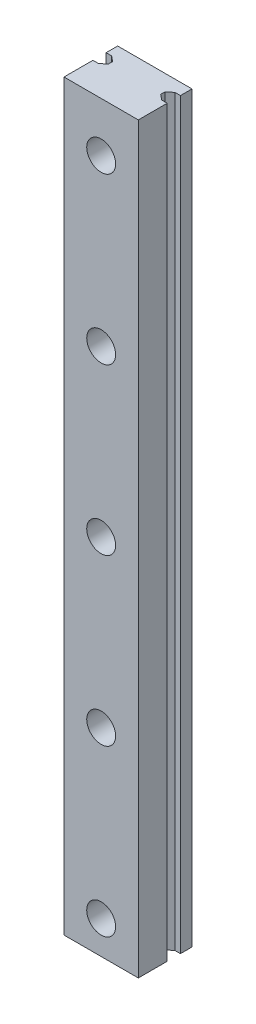
ISO-10303-21;
HEADER;
FILE_DESCRIPTION(('STEP AP214'),'2;1');
FILE_NAME('part.step','',(''),(''),'','','');
FILE_SCHEMA(('AUTOMOTIVE_DESIGN { 1 0 10303 214 1 1 1 1 }'));
ENDSEC;
DATA;
#1=APPLICATION_CONTEXT('core data for automotive mechanical design processes');
#2=APPLICATION_PROTOCOL_DEFINITION('international standard','automotive_design',2000,#1);
#3=PRODUCT_CONTEXT('',#1,'mechanical');
#4=PRODUCT('Part','Part','',(#3));
#5=PRODUCT_RELATED_PRODUCT_CATEGORY('part','',(#4));
#6=PRODUCT_DEFINITION_FORMATION('','',#4);
#7=PRODUCT_DEFINITION_CONTEXT('part definition',#1,'design');
#8=PRODUCT_DEFINITION('design','',#6,#7);
#9=PRODUCT_DEFINITION_SHAPE('','',#8);
#10=(LENGTH_UNIT() NAMED_UNIT(*) SI_UNIT(.MILLI.,.METRE.));
#11=(NAMED_UNIT(*) PLANE_ANGLE_UNIT() SI_UNIT($,.RADIAN.));
#12=(NAMED_UNIT(*) SI_UNIT($,.STERADIAN.) SOLID_ANGLE_UNIT());
#13=UNCERTAINTY_MEASURE_WITH_UNIT(LENGTH_MEASURE(1.E-05),#10,'distance_accuracy_value','');
#14=(GEOMETRIC_REPRESENTATION_CONTEXT(3) GLOBAL_UNCERTAINTY_ASSIGNED_CONTEXT((#13)) GLOBAL_UNIT_ASSIGNED_CONTEXT((#10,
#11,#12)) REPRESENTATION_CONTEXT('',''));
#15=CARTESIAN_POINT('',(0.,0.,0.));
#16=DIRECTION('',(0.,0.,1.));
#17=DIRECTION('',(1.,0.,0.));
#18=AXIS2_PLACEMENT_3D('',#15,#16,#17);
#19=CARTESIAN_POINT('',(3.175,0.,-4.57));
#20=DIRECTION('',(-1.,0.,0.));
#21=DIRECTION('',(0.,0.,1.));
#22=AXIS2_PLACEMENT_3D('',#19,#20,#21);
#23=PLANE('',#22);
#24=DIRECTION('',(0.,1.,0.));
#25=VECTOR('',#24,1.);
#26=CARTESIAN_POINT('',(3.175,45.,-4.57));
#27=LINE('',#26,#25);
#28=CARTESIAN_POINT('',(3.1750000005,0.,-4.569999999875));
#29=VERTEX_POINT('',#28);
#30=CARTESIAN_POINT('',(3.1750000005,90.,-4.569999999875));
#31=VERTEX_POINT('',#30);
#32=EDGE_CURVE('E136',#29,#31,#27,.T.);
#33=ORIENTED_EDGE('',*,*,#32,.T.);
#34=DIRECTION('',(0.,0.,-1.));
#35=VECTOR('',#34,1.);
#36=CARTESIAN_POINT('',(3.175,90.,-4.3));
#37=LINE('',#36,#35);
#38=CARTESIAN_POINT('',(3.175000001,90.,-4.03));
#39=VERTEX_POINT('',#38);
#40=EDGE_CURVE('E132',#39,#31,#37,.T.);
#41=ORIENTED_EDGE('',*,*,#40,.F.);
#42=DIRECTION('',(0.,-1.,0.));
#43=VECTOR('',#42,1.);
#44=CARTESIAN_POINT('',(3.175,45.,-4.03));
#45=LINE('',#44,#43);
#46=CARTESIAN_POINT('',(3.1750000005,0.,-4.03));
#47=VERTEX_POINT('',#46);
#48=EDGE_CURVE('E134',#39,#47,#45,.T.);
#49=ORIENTED_EDGE('',*,*,#48,.T.);
#50=DIRECTION('',(0.,0.,1.));
#51=VECTOR('',#50,1.);
#52=CARTESIAN_POINT('',(3.175,0.,-4.3));
#53=LINE('',#52,#51);
#54=EDGE_CURVE('E126',#29,#47,#53,.T.);
#55=ORIENTED_EDGE('',*,*,#54,.F.);
#56=EDGE_LOOP('',(#33,#41,#49,#55));
#57=FACE_BOUND('',#56,.T.);
#58=ADVANCED_FACE('F17',(#57),#23,.F.);
#59=CARTESIAN_POINT('',(-3.175,0.,-4.03));
#60=DIRECTION('',(1.,0.,0.));
#61=DIRECTION('',(0.,0.,-1.));
#62=AXIS2_PLACEMENT_3D('',#59,#60,#61);
#63=PLANE('',#62);
#64=DIRECTION('',(0.,1.,0.));
#65=VECTOR('',#64,1.);
#66=CARTESIAN_POINT('',(-3.175,45.,-4.03));
#67=LINE('',#66,#65);
#68=CARTESIAN_POINT('',(-3.1750000005,0.,-4.03));
#69=VERTEX_POINT('',#68);
#70=CARTESIAN_POINT('',(-3.1750000005,90.,-4.03));
#71=VERTEX_POINT('',#70);
#72=EDGE_CURVE('E282',#69,#71,#67,.T.);
#73=ORIENTED_EDGE('',*,*,#72,.T.);
#74=DIRECTION('',(0.,0.,1.));
#75=VECTOR('',#74,1.);
#76=CARTESIAN_POINT('',(-3.175,90.,-4.3));
#77=LINE('',#76,#75);
#78=CARTESIAN_POINT('',(-3.175000001,90.,-4.56999999975));
#79=VERTEX_POINT('',#78);
#80=EDGE_CURVE('E154',#79,#71,#77,.T.);
#81=ORIENTED_EDGE('',*,*,#80,.F.);
#82=DIRECTION('',(0.,-1.,0.));
#83=VECTOR('',#82,1.);
#84=CARTESIAN_POINT('',(-3.175,45.,-4.57));
#85=LINE('',#84,#83);
#86=CARTESIAN_POINT('',(-3.1750000005,0.,-4.569999999875));
#87=VERTEX_POINT('',#86);
#88=EDGE_CURVE('E266',#79,#87,#85,.T.);
#89=ORIENTED_EDGE('',*,*,#88,.T.);
#90=DIRECTION('',(0.,0.,-1.));
#91=VECTOR('',#90,1.);
#92=CARTESIAN_POINT('',(-3.175,0.,-4.3));
#93=LINE('',#92,#91);
#94=EDGE_CURVE('E152',#69,#87,#93,.T.);
#95=ORIENTED_EDGE('',*,*,#94,.F.);
#96=EDGE_LOOP('',(#73,#81,#89,#95));
#97=FACE_BOUND('',#96,.T.);
#98=ADVANCED_FACE('F355',(#97),#63,.F.);
#99=CARTESIAN_POINT('',(3.175,0.,-4.03));
#100=DIRECTION('',(-0.624695047554425,0.,0.78086880944303));
#101=DIRECTION('',(0.78086880944303,0.,0.624695047554425));
#102=AXIS2_PLACEMENT_3D('',#99,#100,#101);
#103=PLANE('',#102);
#104=ORIENTED_EDGE('',*,*,#48,.F.);
#105=DIRECTION('',(-0.78086880944303,0.,-0.624695047554425));
#106=VECTOR('',#105,1.);
#107=CARTESIAN_POINT('',(3.50625,90.,-3.765));
#108=LINE('',#107,#106);
#109=CARTESIAN_POINT('',(3.8375000005,90.,-3.4999999985));
#110=VERTEX_POINT('',#109);
#111=EDGE_CURVE('E144',#110,#39,#108,.T.);
#112=ORIENTED_EDGE('',*,*,#111,.F.);
#113=DIRECTION('',(0.,-1.,0.));
#114=VECTOR('',#113,1.);
#115=CARTESIAN_POINT('',(3.8375,45.,-3.5));
#116=LINE('',#115,#114);
#117=CARTESIAN_POINT('',(3.83750000025,0.,-3.49999999925));
#118=VERTEX_POINT('',#117);
#119=EDGE_CURVE('E261',#110,#118,#116,.T.);
#120=ORIENTED_EDGE('',*,*,#119,.T.);
#121=DIRECTION('',(0.78086880944303,0.,0.624695047554425));
#122=VECTOR('',#121,1.);
#123=CARTESIAN_POINT('',(3.50625,0.,-3.765));
#124=LINE('',#123,#122);
#125=EDGE_CURVE('E146',#47,#118,#124,.T.);
#126=ORIENTED_EDGE('',*,*,#125,.F.);
#127=EDGE_LOOP('',(#104,#112,#120,#126));
#128=FACE_BOUND('',#127,.T.);
#129=ADVANCED_FACE('F142',(#128),#103,.F.);
#130=CARTESIAN_POINT('',(-3.8375,0.,-3.5));
#131=DIRECTION('',(0.624695047554425,0.,0.78086880944303));
#132=DIRECTION('',(0.78086880944303,0.,-0.624695047554425));
#133=AXIS2_PLACEMENT_3D('',#130,#131,#132);
#134=PLANE('',#133);
#135=DIRECTION('',(0.,1.,0.));
#136=VECTOR('',#135,1.);
#137=CARTESIAN_POINT('',(-3.8375,45.,-3.5));
#138=LINE('',#137,#136);
#139=CARTESIAN_POINT('',(-3.83750000025,0.,-3.49999999925));
#140=VERTEX_POINT('',#139);
#141=CARTESIAN_POINT('',(-3.83750000025,90.,-3.49999999925));
#142=VERTEX_POINT('',#141);
#143=EDGE_CURVE('E256',#140,#142,#138,.T.);
#144=ORIENTED_EDGE('',*,*,#143,.T.);
#145=DIRECTION('',(-0.78086880944303,0.,0.624695047554425));
#146=VECTOR('',#145,1.);
#147=CARTESIAN_POINT('',(-3.50625,90.,-3.765));
#148=LINE('',#147,#146);
#149=EDGE_CURVE('E280',#71,#142,#148,.T.);
#150=ORIENTED_EDGE('',*,*,#149,.F.);
#151=ORIENTED_EDGE('',*,*,#72,.F.);
#152=DIRECTION('',(0.78086880944303,0.,-0.624695047554425));
#153=VECTOR('',#152,1.);
#154=CARTESIAN_POINT('',(-3.50625,0.,-3.765));
#155=LINE('',#154,#153);
#156=EDGE_CURVE('E277',#140,#69,#155,.T.);
#157=ORIENTED_EDGE('',*,*,#156,.F.);
#158=EDGE_LOOP('',(#144,#150,#151,#157));
#159=FACE_BOUND('',#158,.T.);
#160=ADVANCED_FACE('F360',(#159),#134,.F.);
#161=CARTESIAN_POINT('',(3.8375,0.,-5.1));
#162=DIRECTION('',(-0.624695047554424,0.,-0.780868809443031));
#163=DIRECTION('',(-0.780868809443031,0.,0.624695047554424));
#164=AXIS2_PLACEMENT_3D('',#161,#162,#163);
#165=PLANE('',#164);
#166=DIRECTION('',(0.,1.,0.));
#167=VECTOR('',#166,1.);
#168=CARTESIAN_POINT('',(3.8375,45.,-5.1));
#169=LINE('',#168,#167);
#170=CARTESIAN_POINT('',(3.83750000025,0.,-5.100000000625));
#171=VERTEX_POINT('',#170);
#172=CARTESIAN_POINT('',(3.83750000025,90.,-5.100000000625));
#173=VERTEX_POINT('',#172);
#174=EDGE_CURVE('E248',#171,#173,#169,.T.);
#175=ORIENTED_EDGE('',*,*,#174,.T.);
#176=DIRECTION('',(0.780868809443031,0.,-0.624695047554424));
#177=VECTOR('',#176,1.);
#178=CARTESIAN_POINT('',(3.50625,90.,-4.835));
#179=LINE('',#178,#177);
#180=EDGE_CURVE('E274',#31,#173,#179,.T.);
#181=ORIENTED_EDGE('',*,*,#180,.F.);
#182=ORIENTED_EDGE('',*,*,#32,.F.);
#183=DIRECTION('',(-0.780868809443031,0.,0.624695047554424));
#184=VECTOR('',#183,1.);
#185=CARTESIAN_POINT('',(3.50625,0.,-4.835));
#186=LINE('',#185,#184);
#187=EDGE_CURVE('E272',#171,#29,#186,.T.);
#188=ORIENTED_EDGE('',*,*,#187,.F.);
#189=EDGE_LOOP('',(#175,#181,#182,#188));
#190=FACE_BOUND('',#189,.T.);
#191=ADVANCED_FACE('F441',(#190),#165,.F.);
#192=CARTESIAN_POINT('',(-3.175,0.,-4.57));
#193=DIRECTION('',(0.624695047554424,0.,-0.780868809443031));
#194=DIRECTION('',(-0.780868809443031,0.,-0.624695047554424));
#195=AXIS2_PLACEMENT_3D('',#192,#193,#194);
#196=PLANE('',#195);
#197=ORIENTED_EDGE('',*,*,#88,.F.);
#198=DIRECTION('',(0.780868809443031,0.,0.624695047554424));
#199=VECTOR('',#198,1.);
#200=CARTESIAN_POINT('',(-3.50625,90.,-4.835));
#201=LINE('',#200,#199);
#202=CARTESIAN_POINT('',(-3.83750000025,90.,-5.100000000625));
#203=VERTEX_POINT('',#202);
#204=EDGE_CURVE('E269',#203,#79,#201,.T.);
#205=ORIENTED_EDGE('',*,*,#204,.F.);
#206=DIRECTION('',(0.,-1.,0.));
#207=VECTOR('',#206,1.);
#208=CARTESIAN_POINT('',(-3.8375,45.,-5.1));
#209=LINE('',#208,#207);
#210=CARTESIAN_POINT('',(-3.83750000025,0.,-5.100000000625));
#211=VERTEX_POINT('',#210);
#212=EDGE_CURVE('E240',#203,#211,#209,.T.);
#213=ORIENTED_EDGE('',*,*,#212,.T.);
#214=DIRECTION('',(-0.780868809443031,0.,-0.624695047554424));
#215=VECTOR('',#214,1.);
#216=CARTESIAN_POINT('',(-3.50625,0.,-4.835));
#217=LINE('',#216,#215);
#218=EDGE_CURVE('E264',#87,#211,#217,.T.);
#219=ORIENTED_EDGE('',*,*,#218,.F.);
#220=EDGE_LOOP('',(#197,#205,#213,#219));
#221=FACE_BOUND('',#220,.T.);
#222=ADVANCED_FACE('F353',(#221),#196,.F.);
#223=CARTESIAN_POINT('',(3.8375,0.,-3.5));
#224=DIRECTION('',(0.,0.,1.));
#225=DIRECTION('',(1.,0.,0.));
#226=AXIS2_PLACEMENT_3D('',#223,#224,#225);
#227=PLANE('',#226);
#228=ORIENTED_EDGE('',*,*,#119,.F.);
#229=DIRECTION('',(-1.,0.,0.));
#230=VECTOR('',#229,1.);
#231=CARTESIAN_POINT('',(4.16875,90.,-3.5));
#232=LINE('',#231,#230);
#233=CARTESIAN_POINT('',(4.5,90.,-3.49999999925));
#234=VERTEX_POINT('',#233);
#235=EDGE_CURVE('E151',#234,#110,#232,.T.);
#236=ORIENTED_EDGE('',*,*,#235,.F.);
#237=DIRECTION('',(0.,-1.,0.));
#238=VECTOR('',#237,1.);
#239=CARTESIAN_POINT('',(4.5,45.,-3.5));
#240=LINE('',#239,#238);
#241=CARTESIAN_POINT('',(4.5,0.,-3.49999999925));
#242=VERTEX_POINT('',#241);
#243=EDGE_CURVE('E235',#234,#242,#240,.T.);
#244=ORIENTED_EDGE('',*,*,#243,.T.);
#245=DIRECTION('',(1.,0.,0.));
#246=VECTOR('',#245,1.);
#247=CARTESIAN_POINT('',(4.16875,0.,-3.5));
#248=LINE('',#247,#246);
#249=EDGE_CURVE('E259',#118,#242,#248,.T.);
#250=ORIENTED_EDGE('',*,*,#249,.F.);
#251=EDGE_LOOP('',(#228,#236,#244,#250));
#252=FACE_BOUND('',#251,.T.);
#253=ADVANCED_FACE('F288',(#252),#227,.F.);
#254=CARTESIAN_POINT('',(-4.5,0.,-3.5));
#255=DIRECTION('',(0.,0.,1.));
#256=DIRECTION('',(1.,0.,0.));
#257=AXIS2_PLACEMENT_3D('',#254,#255,#256);
#258=PLANE('',#257);
#259=DIRECTION('',(0.,1.,0.));
#260=VECTOR('',#259,1.);
#261=CARTESIAN_POINT('',(-4.5,45.,-3.5));
#262=LINE('',#261,#260);
#263=CARTESIAN_POINT('',(-4.5,0.,-3.49999999925));
#264=VERTEX_POINT('',#263);
#265=CARTESIAN_POINT('',(-4.5,90.,-3.49999999925));
#266=VERTEX_POINT('',#265);
#267=EDGE_CURVE('E228',#264,#266,#262,.T.);
#268=ORIENTED_EDGE('',*,*,#267,.T.);
#269=DIRECTION('',(-1.,0.,0.));
#270=VECTOR('',#269,1.);
#271=CARTESIAN_POINT('',(-4.16875,90.,-3.5));
#272=LINE('',#271,#270);
#273=EDGE_CURVE('E254',#142,#266,#272,.T.);
#274=ORIENTED_EDGE('',*,*,#273,.F.);
#275=ORIENTED_EDGE('',*,*,#143,.F.);
#276=DIRECTION('',(1.,0.,0.));
#277=VECTOR('',#276,1.);
#278=CARTESIAN_POINT('',(-4.16875,0.,-3.5));
#279=LINE('',#278,#277);
#280=EDGE_CURVE('E251',#264,#140,#279,.T.);
#281=ORIENTED_EDGE('',*,*,#280,.F.);
#282=EDGE_LOOP('',(#268,#274,#275,#281));
#283=FACE_BOUND('',#282,.T.);
#284=ADVANCED_FACE('F363',(#283),#258,.F.);
#285=CARTESIAN_POINT('',(0.,24.,0.));
#286=DIRECTION('',(0.,0.,-1.));
#287=DIRECTION('',(-1.,0.,0.));
#288=AXIS2_PLACEMENT_3D('',#285,#286,#287);
#289=CYLINDRICAL_SURFACE('',#288,1.75);
#290=CARTESIAN_POINT('',(0.,24.,-3.));
#291=DIRECTION('',(0.,0.,-1.));
#292=DIRECTION('',(-1.,0.,0.));
#293=AXIS2_PLACEMENT_3D('',#290,#291,#292);
#294=CIRCLE('',#293,1.75);
#295=CARTESIAN_POINT('',(-1.75,24.,-3.));
#296=VERTEX_POINT('',#295);
#297=EDGE_CURVE('E205',#296,#296,#294,.F.);
#298=ORIENTED_EDGE('',*,*,#297,.F.);
#299=EDGE_LOOP('',(#298));
#300=FACE_BOUND('',#299,.T.);
#301=CARTESIAN_POINT('',(0.,24.,0.));
#302=DIRECTION('',(0.,0.,-1.));
#303=DIRECTION('',(-1.,0.,0.));
#304=AXIS2_PLACEMENT_3D('',#301,#302,#303);
#305=CIRCLE('',#304,1.75);
#306=CARTESIAN_POINT('',(-1.75,24.,0.));
#307=VERTEX_POINT('',#306);
#308=EDGE_CURVE('E21',#307,#307,#305,.F.);
#309=ORIENTED_EDGE('',*,*,#308,.T.);
#310=EDGE_LOOP('',(#309));
#311=FACE_BOUND('',#310,.T.);
#312=ADVANCED_FACE('F428',(#300,#311),#289,.F.);
#313=CARTESIAN_POINT('',(0.,4.,0.));
#314=DIRECTION('',(0.,0.,-1.));
#315=DIRECTION('',(-1.,0.,0.));
#316=AXIS2_PLACEMENT_3D('',#313,#314,#315);
#317=CYLINDRICAL_SURFACE('',#316,1.75);
#318=CARTESIAN_POINT('',(0.,4.,-3.));
#319=DIRECTION('',(0.,0.,-1.));
#320=DIRECTION('',(-1.,0.,0.));
#321=AXIS2_PLACEMENT_3D('',#318,#319,#320);
#322=CIRCLE('',#321,1.75);
#323=CARTESIAN_POINT('',(-1.75,4.,-3.));
#324=VERTEX_POINT('',#323);
#325=EDGE_CURVE('E202',#324,#324,#322,.F.);
#326=ORIENTED_EDGE('',*,*,#325,.F.);
#327=EDGE_LOOP('',(#326));
#328=FACE_BOUND('',#327,.T.);
#329=CARTESIAN_POINT('',(0.,4.,0.));
#330=DIRECTION('',(0.,0.,-1.));
#331=DIRECTION('',(-1.,0.,0.));
#332=AXIS2_PLACEMENT_3D('',#329,#330,#331);
#333=CIRCLE('',#332,1.75);
#334=CARTESIAN_POINT('',(-1.75,4.,0.));
#335=VERTEX_POINT('',#334);
#336=EDGE_CURVE('E213',#335,#335,#333,.F.);
#337=ORIENTED_EDGE('',*,*,#336,.T.);
#338=EDGE_LOOP('',(#337));
#339=FACE_BOUND('',#338,.T.);
#340=ADVANCED_FACE('F424',(#328,#339),#317,.F.);
#341=CARTESIAN_POINT('',(0.,44.,0.));
#342=DIRECTION('',(0.,0.,-1.));
#343=DIRECTION('',(-1.,0.,0.));
#344=AXIS2_PLACEMENT_3D('',#341,#342,#343);
#345=CYLINDRICAL_SURFACE('',#344,1.75);
#346=CARTESIAN_POINT('',(0.,44.,-3.));
#347=DIRECTION('',(0.,0.,-1.));
#348=DIRECTION('',(-1.,0.,0.));
#349=AXIS2_PLACEMENT_3D('',#346,#347,#348);
#350=CIRCLE('',#349,1.75);
#351=CARTESIAN_POINT('',(-1.75,44.,-3.));
#352=VERTEX_POINT('',#351);
#353=EDGE_CURVE('E199',#352,#352,#350,.F.);
#354=ORIENTED_EDGE('',*,*,#353,.F.);
#355=EDGE_LOOP('',(#354));
#356=FACE_BOUND('',#355,.T.);
#357=CARTESIAN_POINT('',(0.,44.,0.));
#358=DIRECTION('',(0.,0.,-1.));
#359=DIRECTION('',(-1.,0.,0.));
#360=AXIS2_PLACEMENT_3D('',#357,#358,#359);
#361=CIRCLE('',#360,1.75);
#362=CARTESIAN_POINT('',(-1.75,44.,0.));
#363=VERTEX_POINT('',#362);
#364=EDGE_CURVE('E211',#363,#363,#361,.F.);
#365=ORIENTED_EDGE('',*,*,#364,.T.);
#366=EDGE_LOOP('',(#365));
#367=FACE_BOUND('',#366,.T.);
#368=ADVANCED_FACE('F420',(#356,#367),#345,.F.);
#369=CARTESIAN_POINT('',(0.,64.,0.));
#370=DIRECTION('',(0.,0.,-1.));
#371=DIRECTION('',(-1.,0.,0.));
#372=AXIS2_PLACEMENT_3D('',#369,#370,#371);
#373=CYLINDRICAL_SURFACE('',#372,1.75);
#374=CARTESIAN_POINT('',(0.,64.,-3.));
#375=DIRECTION('',(0.,0.,-1.));
#376=DIRECTION('',(-1.,0.,0.));
#377=AXIS2_PLACEMENT_3D('',#374,#375,#376);
#378=CIRCLE('',#377,1.75);
#379=CARTESIAN_POINT('',(-1.75,64.,-3.));
#380=VERTEX_POINT('',#379);
#381=EDGE_CURVE('E196',#380,#380,#378,.F.);
#382=ORIENTED_EDGE('',*,*,#381,.F.);
#383=EDGE_LOOP('',(#382));
#384=FACE_BOUND('',#383,.T.);
#385=CARTESIAN_POINT('',(0.,64.,0.));
#386=DIRECTION('',(0.,0.,-1.));
#387=DIRECTION('',(-1.,0.,0.));
#388=AXIS2_PLACEMENT_3D('',#385,#386,#387);
#389=CIRCLE('',#388,1.75);
#390=CARTESIAN_POINT('',(-1.75,64.,0.));
#391=VERTEX_POINT('',#390);
#392=EDGE_CURVE('E208',#391,#391,#389,.F.);
#393=ORIENTED_EDGE('',*,*,#392,.T.);
#394=EDGE_LOOP('',(#393));
#395=FACE_BOUND('',#394,.T.);
#396=ADVANCED_FACE('F417',(#384,#395),#373,.F.);
#397=CARTESIAN_POINT('',(4.5,0.,-5.1));
#398=DIRECTION('',(0.,0.,-1.));
#399=DIRECTION('',(-1.,0.,0.));
#400=AXIS2_PLACEMENT_3D('',#397,#398,#399);
#401=PLANE('',#400);
#402=DIRECTION('',(0.,1.,0.));
#403=VECTOR('',#402,1.);
#404=CARTESIAN_POINT('',(4.5,45.,-5.1));
#405=LINE('',#404,#403);
#406=CARTESIAN_POINT('',(4.5,0.,-5.100000000625));
#407=VERTEX_POINT('',#406);
#408=CARTESIAN_POINT('',(4.5,90.,-5.100000000625));
#409=VERTEX_POINT('',#408);
#410=EDGE_CURVE('E195',#407,#409,#405,.T.);
#411=ORIENTED_EDGE('',*,*,#410,.T.);
#412=DIRECTION('',(1.,0.,0.));
#413=VECTOR('',#412,1.);
#414=CARTESIAN_POINT('',(4.16875,90.,-5.1));
#415=LINE('',#414,#413);
#416=EDGE_CURVE('E246',#173,#409,#415,.T.);
#417=ORIENTED_EDGE('',*,*,#416,.F.);
#418=ORIENTED_EDGE('',*,*,#174,.F.);
#419=DIRECTION('',(-1.,0.,0.));
#420=VECTOR('',#419,1.);
#421=CARTESIAN_POINT('',(4.16875,0.,-5.1));
#422=LINE('',#421,#420);
#423=EDGE_CURVE('E243',#407,#171,#422,.T.);
#424=ORIENTED_EDGE('',*,*,#423,.F.);
#425=EDGE_LOOP('',(#411,#417,#418,#424));
#426=FACE_BOUND('',#425,.T.);
#427=ADVANCED_FACE('F322',(#426),#401,.F.);
#428=CARTESIAN_POINT('',(-3.8375,0.,-5.1));
#429=DIRECTION('',(0.,0.,-1.));
#430=DIRECTION('',(-1.,0.,0.));
#431=AXIS2_PLACEMENT_3D('',#428,#429,#430);
#432=PLANE('',#431);
#433=ORIENTED_EDGE('',*,*,#212,.F.);
#434=DIRECTION('',(1.,0.,0.));
#435=VECTOR('',#434,1.);
#436=CARTESIAN_POINT('',(0.,90.,-5.1000000025));
#437=LINE('',#436,#435);
#438=CARTESIAN_POINT('',(-4.5,90.,-5.10000000125));
#439=VERTEX_POINT('',#438);
#440=EDGE_CURVE('E308',#439,#203,#437,.T.);
#441=ORIENTED_EDGE('',*,*,#440,.F.);
#442=DIRECTION('',(0.,-1.,0.));
#443=VECTOR('',#442,1.);
#444=CARTESIAN_POINT('',(-4.5,45.,-5.1));
#445=LINE('',#444,#443);
#446=CARTESIAN_POINT('',(-4.5,0.,-5.100000000625));
#447=VERTEX_POINT('',#446);
#448=EDGE_CURVE('E294',#439,#447,#445,.T.);
#449=ORIENTED_EDGE('',*,*,#448,.T.);
#450=DIRECTION('',(-1.,0.,0.));
#451=VECTOR('',#450,1.);
#452=CARTESIAN_POINT('',(-4.16875,0.,-5.1));
#453=LINE('',#452,#451);
#454=EDGE_CURVE('E238',#211,#447,#453,.T.);
#455=ORIENTED_EDGE('',*,*,#454,.F.);
#456=EDGE_LOOP('',(#433,#441,#449,#455));
#457=FACE_BOUND('',#456,.T.);
#458=ADVANCED_FACE('F348',(#457),#432,.F.);
#459=CARTESIAN_POINT('',(4.5,0.,-3.5));
#460=DIRECTION('',(-1.,0.,0.));
#461=DIRECTION('',(0.,0.,1.));
#462=AXIS2_PLACEMENT_3D('',#459,#460,#461);
#463=PLANE('',#462);
#464=ORIENTED_EDGE('',*,*,#243,.F.);
#465=DIRECTION('',(0.,0.,-1.));
#466=VECTOR('',#465,1.);
#467=CARTESIAN_POINT('',(4.5,90.,-3.25));
#468=LINE('',#467,#466);
#469=CARTESIAN_POINT('',(4.5,90.,0.));
#470=VERTEX_POINT('',#469);
#471=EDGE_CURVE('E313',#470,#234,#468,.T.);
#472=ORIENTED_EDGE('',*,*,#471,.F.);
#473=DIRECTION('',(0.,-1.,0.));
#474=VECTOR('',#473,1.);
#475=CARTESIAN_POINT('',(4.5,45.,0.));
#476=LINE('',#475,#474);
#477=CARTESIAN_POINT('',(4.5,0.,0.));
#478=VERTEX_POINT('',#477);
#479=EDGE_CURVE('E218',#470,#478,#476,.T.);
#480=ORIENTED_EDGE('',*,*,#479,.T.);
#481=DIRECTION('',(0.,0.,-1.));
#482=VECTOR('',#481,1.);
#483=CARTESIAN_POINT('',(4.5,0.,-3.25));
#484=LINE('',#483,#482);
#485=EDGE_CURVE('E290',#478,#242,#484,.T.);
#486=ORIENTED_EDGE('',*,*,#485,.T.);
#487=EDGE_LOOP('',(#464,#472,#480,#486));
#488=FACE_BOUND('',#487,.T.);
#489=ADVANCED_FACE('F291',(#488),#463,.F.);
#490=CARTESIAN_POINT('',(-4.5,0.,0.));
#491=DIRECTION('',(1.,0.,0.));
#492=DIRECTION('',(0.,0.,-1.));
#493=AXIS2_PLACEMENT_3D('',#490,#491,#492);
#494=PLANE('',#493);
#495=DIRECTION('',(0.,1.,0.));
#496=VECTOR('',#495,1.);
#497=CARTESIAN_POINT('',(-4.5,45.,0.));
#498=LINE('',#497,#496);
#499=CARTESIAN_POINT('',(-4.5,0.,0.));
#500=VERTEX_POINT('',#499);
#501=CARTESIAN_POINT('',(-4.5,90.,0.));
#502=VERTEX_POINT('',#501);
#503=EDGE_CURVE('E222',#500,#502,#498,.T.);
#504=ORIENTED_EDGE('',*,*,#503,.T.);
#505=DIRECTION('',(0.,0.,1.));
#506=VECTOR('',#505,1.);
#507=CARTESIAN_POINT('',(-4.5,90.,-3.25));
#508=LINE('',#507,#506);
#509=EDGE_CURVE('E305',#266,#502,#508,.T.);
#510=ORIENTED_EDGE('',*,*,#509,.F.);
#511=ORIENTED_EDGE('',*,*,#267,.F.);
#512=DIRECTION('',(0.,0.,1.));
#513=VECTOR('',#512,1.);
#514=CARTESIAN_POINT('',(-4.5,0.,-3.25));
#515=LINE('',#514,#513);
#516=EDGE_CURVE('E341',#264,#500,#515,.T.);
#517=ORIENTED_EDGE('',*,*,#516,.T.);
#518=EDGE_LOOP('',(#504,#510,#511,#517));
#519=FACE_BOUND('',#518,.T.);
#520=ADVANCED_FACE('F366',(#519),#494,.F.);
#521=CARTESIAN_POINT('',(4.5,0.,0.));
#522=DIRECTION('',(0.,0.,-1.));
#523=DIRECTION('',(-1.,0.,0.));
#524=AXIS2_PLACEMENT_3D('',#521,#522,#523);
#525=PLANE('',#524);
#526=CARTESIAN_POINT('',(0.,84.,0.));
#527=DIRECTION('',(0.,0.,-1.));
#528=DIRECTION('',(-1.,0.,0.));
#529=AXIS2_PLACEMENT_3D('',#526,#527,#528);
#530=CIRCLE('',#529,1.75);
#531=CARTESIAN_POINT('',(-1.75,84.,0.));
#532=VERTEX_POINT('',#531);
#533=EDGE_CURVE('E192',#532,#532,#530,.F.);
#534=ORIENTED_EDGE('',*,*,#533,.F.);
#535=EDGE_LOOP('',(#534));
#536=FACE_BOUND('',#535,.T.);
#537=ORIENTED_EDGE('',*,*,#392,.F.);
#538=EDGE_LOOP('',(#537));
#539=FACE_BOUND('',#538,.T.);
#540=ORIENTED_EDGE('',*,*,#364,.F.);
#541=EDGE_LOOP('',(#540));
#542=FACE_BOUND('',#541,.T.);
#543=ORIENTED_EDGE('',*,*,#336,.F.);
#544=EDGE_LOOP('',(#543));
#545=FACE_BOUND('',#544,.T.);
#546=ORIENTED_EDGE('',*,*,#308,.F.);
#547=EDGE_LOOP('',(#546));
#548=FACE_BOUND('',#547,.T.);
#549=ORIENTED_EDGE('',*,*,#479,.F.);
#550=DIRECTION('',(1.,0.,0.));
#551=VECTOR('',#550,1.);
#552=CARTESIAN_POINT('',(0.,90.,0.));
#553=LINE('',#552,#551);
#554=EDGE_CURVE('E314',#502,#470,#553,.T.);
#555=ORIENTED_EDGE('',*,*,#554,.F.);
#556=ORIENTED_EDGE('',*,*,#503,.F.);
#557=DIRECTION('',(1.,0.,0.));
#558=VECTOR('',#557,1.);
#559=CARTESIAN_POINT('',(0.,0.,0.));
#560=LINE('',#559,#558);
#561=EDGE_CURVE('E191',#500,#478,#560,.T.);
#562=ORIENTED_EDGE('',*,*,#561,.T.);
#563=EDGE_LOOP('',(#549,#555,#556,#562));
#564=FACE_BOUND('',#563,.T.);
#565=ADVANCED_FACE('F369',(#536,#539,#542,#545,#548,#564),#525,.F.);
#566=CARTESIAN_POINT('',(3.036,20.964,-3.));
#567=DIRECTION('',(0.,0.,-1.));
#568=DIRECTION('',(-1.,0.,0.));
#569=AXIS2_PLACEMENT_3D('',#566,#567,#568);
#570=PLANE('',#569);
#571=ORIENTED_EDGE('',*,*,#297,.T.);
#572=EDGE_LOOP('',(#571));
#573=FACE_BOUND('',#572,.T.);
#574=CARTESIAN_POINT('',(0.,24.,-3.));
#575=DIRECTION('',(0.,0.,-1.));
#576=DIRECTION('',(-1.,0.,0.));
#577=AXIS2_PLACEMENT_3D('',#574,#575,#576);
#578=CIRCLE('',#577,3.);
#579=CARTESIAN_POINT('',(-3.,24.,-3.));
#580=VERTEX_POINT('',#579);
#581=EDGE_CURVE('E188',#580,#580,#578,.F.);
#582=ORIENTED_EDGE('',*,*,#581,.F.);
#583=EDGE_LOOP('',(#582));
#584=FACE_BOUND('',#583,.T.);
#585=ADVANCED_FACE('F371',(#573,#584),#570,.T.);
#586=CARTESIAN_POINT('',(3.036,0.964,-3.));
#587=DIRECTION('',(0.,0.,-1.));
#588=DIRECTION('',(-1.,0.,0.));
#589=AXIS2_PLACEMENT_3D('',#586,#587,#588);
#590=PLANE('',#589);
#591=ORIENTED_EDGE('',*,*,#325,.T.);
#592=EDGE_LOOP('',(#591));
#593=FACE_BOUND('',#592,.T.);
#594=CARTESIAN_POINT('',(0.,4.,-3.));
#595=DIRECTION('',(0.,0.,-1.));
#596=DIRECTION('',(-1.,0.,0.));
#597=AXIS2_PLACEMENT_3D('',#594,#595,#596);
#598=CIRCLE('',#597,3.);
#599=CARTESIAN_POINT('',(-3.,4.,-3.));
#600=VERTEX_POINT('',#599);
#601=EDGE_CURVE('E185',#600,#600,#598,.F.);
#602=ORIENTED_EDGE('',*,*,#601,.F.);
#603=EDGE_LOOP('',(#602));
#604=FACE_BOUND('',#603,.T.);
#605=ADVANCED_FACE('F379',(#593,#604),#590,.T.);
#606=CARTESIAN_POINT('',(3.036,40.964,-3.));
#607=DIRECTION('',(0.,0.,-1.));
#608=DIRECTION('',(-1.,0.,0.));
#609=AXIS2_PLACEMENT_3D('',#606,#607,#608);
#610=PLANE('',#609);
#611=ORIENTED_EDGE('',*,*,#353,.T.);
#612=EDGE_LOOP('',(#611));
#613=FACE_BOUND('',#612,.T.);
#614=CARTESIAN_POINT('',(0.,44.,-3.));
#615=DIRECTION('',(0.,0.,-1.));
#616=DIRECTION('',(-1.,0.,0.));
#617=AXIS2_PLACEMENT_3D('',#614,#615,#616);
#618=CIRCLE('',#617,3.);
#619=CARTESIAN_POINT('',(-3.,44.,-3.));
#620=VERTEX_POINT('',#619);
#621=EDGE_CURVE('E182',#620,#620,#618,.F.);
#622=ORIENTED_EDGE('',*,*,#621,.F.);
#623=EDGE_LOOP('',(#622));
#624=FACE_BOUND('',#623,.T.);
#625=ADVANCED_FACE('F488',(#613,#624),#610,.T.);
#626=CARTESIAN_POINT('',(3.036,60.964,-3.));
#627=DIRECTION('',(0.,0.,-1.));
#628=DIRECTION('',(-1.,0.,0.));
#629=AXIS2_PLACEMENT_3D('',#626,#627,#628);
#630=PLANE('',#629);
#631=ORIENTED_EDGE('',*,*,#381,.T.);
#632=EDGE_LOOP('',(#631));
#633=FACE_BOUND('',#632,.T.);
#634=CARTESIAN_POINT('',(0.,64.,-3.));
#635=DIRECTION('',(0.,0.,-1.));
#636=DIRECTION('',(-1.,0.,0.));
#637=AXIS2_PLACEMENT_3D('',#634,#635,#636);
#638=CIRCLE('',#637,3.);
#639=CARTESIAN_POINT('',(-3.,64.,-3.));
#640=VERTEX_POINT('',#639);
#641=EDGE_CURVE('E179',#640,#640,#638,.F.);
#642=ORIENTED_EDGE('',*,*,#641,.F.);
#643=EDGE_LOOP('',(#642));
#644=FACE_BOUND('',#643,.T.);
#645=ADVANCED_FACE('F415',(#633,#644),#630,.T.);
#646=CARTESIAN_POINT('',(0.,84.,0.));
#647=DIRECTION('',(0.,0.,-1.));
#648=DIRECTION('',(-1.,0.,0.));
#649=AXIS2_PLACEMENT_3D('',#646,#647,#648);
#650=CYLINDRICAL_SURFACE('',#649,1.75);
#651=CARTESIAN_POINT('',(0.,84.,-3.));
#652=DIRECTION('',(0.,0.,-1.));
#653=DIRECTION('',(-1.,0.,0.));
#654=AXIS2_PLACEMENT_3D('',#651,#652,#653);
#655=CIRCLE('',#654,1.75);
#656=CARTESIAN_POINT('',(-1.75,84.,-3.));
#657=VERTEX_POINT('',#656);
#658=EDGE_CURVE('E175',#657,#657,#655,.F.);
#659=ORIENTED_EDGE('',*,*,#658,.F.);
#660=EDGE_LOOP('',(#659));
#661=FACE_BOUND('',#660,.T.);
#662=ORIENTED_EDGE('',*,*,#533,.T.);
#663=EDGE_LOOP('',(#662));
#664=FACE_BOUND('',#663,.T.);
#665=ADVANCED_FACE('F412',(#661,#664),#650,.F.);
#666=CARTESIAN_POINT('',(4.5,0.,-6.5));
#667=DIRECTION('',(-1.,0.,0.));
#668=DIRECTION('',(0.,0.,1.));
#669=AXIS2_PLACEMENT_3D('',#666,#667,#668);
#670=PLANE('',#669);
#671=DIRECTION('',(0.,1.,0.));
#672=VECTOR('',#671,1.);
#673=CARTESIAN_POINT('',(4.5,45.,-6.5));
#674=LINE('',#673,#672);
#675=CARTESIAN_POINT('',(4.5,0.,-6.5));
#676=VERTEX_POINT('',#675);
#677=CARTESIAN_POINT('',(4.5,90.,-6.5));
#678=VERTEX_POINT('',#677);
#679=EDGE_CURVE('E178',#676,#678,#674,.T.);
#680=ORIENTED_EDGE('',*,*,#679,.T.);
#681=DIRECTION('',(0.,0.,-1.));
#682=VECTOR('',#681,1.);
#683=CARTESIAN_POINT('',(4.5,90.,-3.25));
#684=LINE('',#683,#682);
#685=EDGE_CURVE('E311',#409,#678,#684,.T.);
#686=ORIENTED_EDGE('',*,*,#685,.F.);
#687=ORIENTED_EDGE('',*,*,#410,.F.);
#688=DIRECTION('',(0.,0.,-1.));
#689=VECTOR('',#688,1.);
#690=CARTESIAN_POINT('',(4.5,0.,-3.25));
#691=LINE('',#690,#689);
#692=EDGE_CURVE('E293',#407,#676,#691,.T.);
#693=ORIENTED_EDGE('',*,*,#692,.T.);
#694=EDGE_LOOP('',(#680,#686,#687,#693));
#695=FACE_BOUND('',#694,.T.);
#696=ADVANCED_FACE('F327',(#695),#670,.F.);
#697=CARTESIAN_POINT('',(-4.5,90.,-6.5));
#698=DIRECTION('',(0.,1.,0.));
#699=DIRECTION('',(0.,0.,1.));
#700=AXIS2_PLACEMENT_3D('',#697,#698,#699);
#701=PLANE('',#700);
#702=ORIENTED_EDGE('',*,*,#273,.T.);
#703=ORIENTED_EDGE('',*,*,#509,.T.);
#704=ORIENTED_EDGE('',*,*,#554,.T.);
#705=ORIENTED_EDGE('',*,*,#471,.T.);
#706=ORIENTED_EDGE('',*,*,#235,.T.);
#707=ORIENTED_EDGE('',*,*,#111,.T.);
#708=ORIENTED_EDGE('',*,*,#40,.T.);
#709=ORIENTED_EDGE('',*,*,#180,.T.);
#710=ORIENTED_EDGE('',*,*,#416,.T.);
#711=ORIENTED_EDGE('',*,*,#685,.T.);
#712=DIRECTION('',(-1.,0.,0.));
#713=VECTOR('',#712,1.);
#714=CARTESIAN_POINT('',(0.,90.,-6.5));
#715=LINE('',#714,#713);
#716=CARTESIAN_POINT('',(-4.5,90.,-6.5));
#717=VERTEX_POINT('',#716);
#718=EDGE_CURVE('E330',#678,#717,#715,.T.);
#719=ORIENTED_EDGE('',*,*,#718,.T.);
#720=DIRECTION('',(0.,0.,1.));
#721=VECTOR('',#720,1.);
#722=CARTESIAN_POINT('',(-4.5,90.,-5.8));
#723=LINE('',#722,#721);
#724=EDGE_CURVE('E299',#717,#439,#723,.T.);
#725=ORIENTED_EDGE('',*,*,#724,.T.);
#726=ORIENTED_EDGE('',*,*,#440,.T.);
#727=ORIENTED_EDGE('',*,*,#204,.T.);
#728=ORIENTED_EDGE('',*,*,#80,.T.);
#729=ORIENTED_EDGE('',*,*,#149,.T.);
#730=EDGE_LOOP('',(#702,#703,#704,#705,#706,#707,#708,#709,#710,#711,#719,#725,#726,#727,#728,#729));
#731=FACE_BOUND('',#730,.T.);
#732=ADVANCED_FACE('F149',(#731),#701,.T.);
#733=CARTESIAN_POINT('',(-4.5,0.,-5.1));
#734=DIRECTION('',(1.,0.,0.));
#735=DIRECTION('',(0.,0.,-1.));
#736=AXIS2_PLACEMENT_3D('',#733,#734,#735);
#737=PLANE('',#736);
#738=ORIENTED_EDGE('',*,*,#448,.F.);
#739=ORIENTED_EDGE('',*,*,#724,.F.);
#740=DIRECTION('',(0.,-1.,0.));
#741=VECTOR('',#740,1.);
#742=CARTESIAN_POINT('',(-4.5,45.,-6.5));
#743=LINE('',#742,#741);
#744=CARTESIAN_POINT('',(-4.5,0.,-6.5));
#745=VERTEX_POINT('',#744);
#746=EDGE_CURVE('E334',#717,#745,#743,.T.);
#747=ORIENTED_EDGE('',*,*,#746,.T.);
#748=DIRECTION('',(0.,0.,1.));
#749=VECTOR('',#748,1.);
#750=CARTESIAN_POINT('',(-4.5,0.,-3.25));
#751=LINE('',#750,#749);
#752=EDGE_CURVE('E36',#745,#447,#751,.T.);
#753=ORIENTED_EDGE('',*,*,#752,.T.);
#754=EDGE_LOOP('',(#738,#739,#747,#753));
#755=FACE_BOUND('',#754,.T.);
#756=ADVANCED_FACE('F345',(#755),#737,.F.);
#757=CARTESIAN_POINT('',(-4.5,0.,-6.5));
#758=DIRECTION('',(0.,1.,0.));
#759=DIRECTION('',(0.,0.,1.));
#760=AXIS2_PLACEMENT_3D('',#757,#758,#759);
#761=PLANE('',#760);
#762=ORIENTED_EDGE('',*,*,#516,.F.);
#763=ORIENTED_EDGE('',*,*,#280,.T.);
#764=ORIENTED_EDGE('',*,*,#156,.T.);
#765=ORIENTED_EDGE('',*,*,#94,.T.);
#766=ORIENTED_EDGE('',*,*,#218,.T.);
#767=ORIENTED_EDGE('',*,*,#454,.T.);
#768=ORIENTED_EDGE('',*,*,#752,.F.);
#769=DIRECTION('',(1.,0.,0.));
#770=VECTOR('',#769,1.);
#771=CARTESIAN_POINT('',(0.,0.,-6.5));
#772=LINE('',#771,#770);
#773=EDGE_CURVE('E174',#745,#676,#772,.T.);
#774=ORIENTED_EDGE('',*,*,#773,.T.);
#775=ORIENTED_EDGE('',*,*,#692,.F.);
#776=ORIENTED_EDGE('',*,*,#423,.T.);
#777=ORIENTED_EDGE('',*,*,#187,.T.);
#778=ORIENTED_EDGE('',*,*,#54,.T.);
#779=ORIENTED_EDGE('',*,*,#125,.T.);
#780=ORIENTED_EDGE('',*,*,#249,.T.);
#781=ORIENTED_EDGE('',*,*,#485,.F.);
#782=ORIENTED_EDGE('',*,*,#561,.F.);
#783=EDGE_LOOP('',(#762,#763,#764,#765,#766,#767,#768,#774,#775,#776,#777,#778,#779,#780,#781,#782));
#784=FACE_BOUND('',#783,.T.);
#785=ADVANCED_FACE('F286',(#784),#761,.F.);
#786=CARTESIAN_POINT('',(0.,24.,-3.));
#787=DIRECTION('',(0.,0.,-1.));
#788=DIRECTION('',(-1.,0.,0.));
#789=AXIS2_PLACEMENT_3D('',#786,#787,#788);
#790=CYLINDRICAL_SURFACE('',#789,3.);
#791=ORIENTED_EDGE('',*,*,#581,.T.);
#792=EDGE_LOOP('',(#791));
#793=FACE_BOUND('',#792,.T.);
#794=CARTESIAN_POINT('',(0.,24.,-6.5));
#795=DIRECTION('',(0.,0.,-1.));
#796=DIRECTION('',(-1.,0.,0.));
#797=AXIS2_PLACEMENT_3D('',#794,#795,#796);
#798=CIRCLE('',#797,3.);
#799=CARTESIAN_POINT('',(-3.,24.,-6.5));
#800=VERTEX_POINT('',#799);
#801=EDGE_CURVE('E171',#800,#800,#798,.T.);
#802=ORIENTED_EDGE('',*,*,#801,.T.);
#803=EDGE_LOOP('',(#802));
#804=FACE_BOUND('',#803,.T.);
#805=ADVANCED_FACE('F407',(#793,#804),#790,.F.);
#806=CARTESIAN_POINT('',(0.,4.,-3.));
#807=DIRECTION('',(0.,0.,-1.));
#808=DIRECTION('',(-1.,0.,0.));
#809=AXIS2_PLACEMENT_3D('',#806,#807,#808);
#810=CYLINDRICAL_SURFACE('',#809,3.);
#811=ORIENTED_EDGE('',*,*,#601,.T.);
#812=EDGE_LOOP('',(#811));
#813=FACE_BOUND('',#812,.T.);
#814=CARTESIAN_POINT('',(0.,4.,-6.5));
#815=DIRECTION('',(0.,0.,-1.));
#816=DIRECTION('',(-1.,0.,0.));
#817=AXIS2_PLACEMENT_3D('',#814,#815,#816);
#818=CIRCLE('',#817,3.);
#819=CARTESIAN_POINT('',(-3.,4.,-6.5));
#820=VERTEX_POINT('',#819);
#821=EDGE_CURVE('E168',#820,#820,#818,.T.);
#822=ORIENTED_EDGE('',*,*,#821,.T.);
#823=EDGE_LOOP('',(#822));
#824=FACE_BOUND('',#823,.T.);
#825=ADVANCED_FACE('F403',(#813,#824),#810,.F.);
#826=CARTESIAN_POINT('',(0.,44.,-3.));
#827=DIRECTION('',(0.,0.,-1.));
#828=DIRECTION('',(-1.,0.,0.));
#829=AXIS2_PLACEMENT_3D('',#826,#827,#828);
#830=CYLINDRICAL_SURFACE('',#829,3.);
#831=ORIENTED_EDGE('',*,*,#621,.T.);
#832=EDGE_LOOP('',(#831));
#833=FACE_BOUND('',#832,.T.);
#834=CARTESIAN_POINT('',(0.,44.,-6.5));
#835=DIRECTION('',(0.,0.,-1.));
#836=DIRECTION('',(-1.,0.,0.));
#837=AXIS2_PLACEMENT_3D('',#834,#835,#836);
#838=CIRCLE('',#837,3.);
#839=CARTESIAN_POINT('',(-3.,44.,-6.5));
#840=VERTEX_POINT('',#839);
#841=EDGE_CURVE('E165',#840,#840,#838,.T.);
#842=ORIENTED_EDGE('',*,*,#841,.T.);
#843=EDGE_LOOP('',(#842));
#844=FACE_BOUND('',#843,.T.);
#845=ADVANCED_FACE('F399',(#833,#844),#830,.F.);
#846=CARTESIAN_POINT('',(0.,64.,-3.));
#847=DIRECTION('',(0.,0.,-1.));
#848=DIRECTION('',(-1.,0.,0.));
#849=AXIS2_PLACEMENT_3D('',#846,#847,#848);
#850=CYLINDRICAL_SURFACE('',#849,3.);
#851=ORIENTED_EDGE('',*,*,#641,.T.);
#852=EDGE_LOOP('',(#851));
#853=FACE_BOUND('',#852,.T.);
#854=CARTESIAN_POINT('',(0.,64.,-6.5));
#855=DIRECTION('',(0.,0.,-1.));
#856=DIRECTION('',(-1.,0.,0.));
#857=AXIS2_PLACEMENT_3D('',#854,#855,#856);
#858=CIRCLE('',#857,3.);
#859=CARTESIAN_POINT('',(-3.,64.,-6.5));
#860=VERTEX_POINT('',#859);
#861=EDGE_CURVE('E162',#860,#860,#858,.T.);
#862=ORIENTED_EDGE('',*,*,#861,.T.);
#863=EDGE_LOOP('',(#862));
#864=FACE_BOUND('',#863,.T.);
#865=ADVANCED_FACE('F396',(#853,#864),#850,.F.);
#866=CARTESIAN_POINT('',(3.036,80.964,-3.));
#867=DIRECTION('',(0.,0.,-1.));
#868=DIRECTION('',(-1.,0.,0.));
#869=AXIS2_PLACEMENT_3D('',#866,#867,#868);
#870=PLANE('',#869);
#871=ORIENTED_EDGE('',*,*,#658,.T.);
#872=EDGE_LOOP('',(#871));
#873=FACE_BOUND('',#872,.T.);
#874=CARTESIAN_POINT('',(0.,84.,-3.));
#875=DIRECTION('',(0.,0.,-1.));
#876=DIRECTION('',(-1.,0.,0.));
#877=AXIS2_PLACEMENT_3D('',#874,#875,#876);
#878=CIRCLE('',#877,3.);
#879=CARTESIAN_POINT('',(-3.,84.,-3.));
#880=VERTEX_POINT('',#879);
#881=EDGE_CURVE('E27',#880,#880,#878,.F.);
#882=ORIENTED_EDGE('',*,*,#881,.F.);
#883=EDGE_LOOP('',(#882));
#884=FACE_BOUND('',#883,.T.);
#885=ADVANCED_FACE('F392',(#873,#884),#870,.T.);
#886=CARTESIAN_POINT('',(-4.5,0.,-6.5));
#887=DIRECTION('',(0.,0.,1.));
#888=DIRECTION('',(1.,0.,0.));
#889=AXIS2_PLACEMENT_3D('',#886,#887,#888);
#890=PLANE('',#889);
#891=CARTESIAN_POINT('',(0.,84.,-6.5));
#892=DIRECTION('',(0.,0.,-1.));
#893=DIRECTION('',(-1.,0.,0.));
#894=AXIS2_PLACEMENT_3D('',#891,#892,#893);
#895=CIRCLE('',#894,3.);
#896=CARTESIAN_POINT('',(-3.,84.,-6.5));
#897=VERTEX_POINT('',#896);
#898=EDGE_CURVE('E11',#897,#897,#895,.T.);
#899=ORIENTED_EDGE('',*,*,#898,.F.);
#900=EDGE_LOOP('',(#899));
#901=FACE_BOUND('',#900,.T.);
#902=ORIENTED_EDGE('',*,*,#861,.F.);
#903=EDGE_LOOP('',(#902));
#904=FACE_BOUND('',#903,.T.);
#905=ORIENTED_EDGE('',*,*,#841,.F.);
#906=EDGE_LOOP('',(#905));
#907=FACE_BOUND('',#906,.T.);
#908=ORIENTED_EDGE('',*,*,#821,.F.);
#909=EDGE_LOOP('',(#908));
#910=FACE_BOUND('',#909,.T.);
#911=ORIENTED_EDGE('',*,*,#801,.F.);
#912=EDGE_LOOP('',(#911));
#913=FACE_BOUND('',#912,.T.);
#914=ORIENTED_EDGE('',*,*,#746,.F.);
#915=ORIENTED_EDGE('',*,*,#718,.F.);
#916=ORIENTED_EDGE('',*,*,#679,.F.);
#917=ORIENTED_EDGE('',*,*,#773,.F.);
#918=EDGE_LOOP('',(#914,#915,#916,#917));
#919=FACE_BOUND('',#918,.T.);
#920=ADVANCED_FACE('F19',(#901,#904,#907,#910,#913,#919),#890,.F.);
#921=CARTESIAN_POINT('',(0.,84.,-3.));
#922=DIRECTION('',(0.,0.,-1.));
#923=DIRECTION('',(-1.,0.,0.));
#924=AXIS2_PLACEMENT_3D('',#921,#922,#923);
#925=CYLINDRICAL_SURFACE('',#924,3.);
#926=ORIENTED_EDGE('',*,*,#898,.T.);
#927=EDGE_LOOP('',(#926));
#928=FACE_BOUND('',#927,.T.);
#929=ORIENTED_EDGE('',*,*,#881,.T.);
#930=EDGE_LOOP('',(#929));
#931=FACE_BOUND('',#930,.T.);
#932=ADVANCED_FACE('F385',(#928,#931),#925,.F.);
#933=CLOSED_SHELL('',(#58,#98,#129,#160,#191,#222,#253,#284,#312,#340,#368,#396,#427,#458,#489,
#520,#565,#585,#605,#625,#645,#665,#696,#732,#756,#785,#805,#825,#845,#865,#885,#920,#932));
#934=MANIFOLD_SOLID_BREP('B1',#933);
#935=ADVANCED_BREP_SHAPE_REPRESENTATION('',(#18,#934),#14);
#936=SHAPE_DEFINITION_REPRESENTATION(#9,#935);
ENDSEC;
END-ISO-10303-21;
